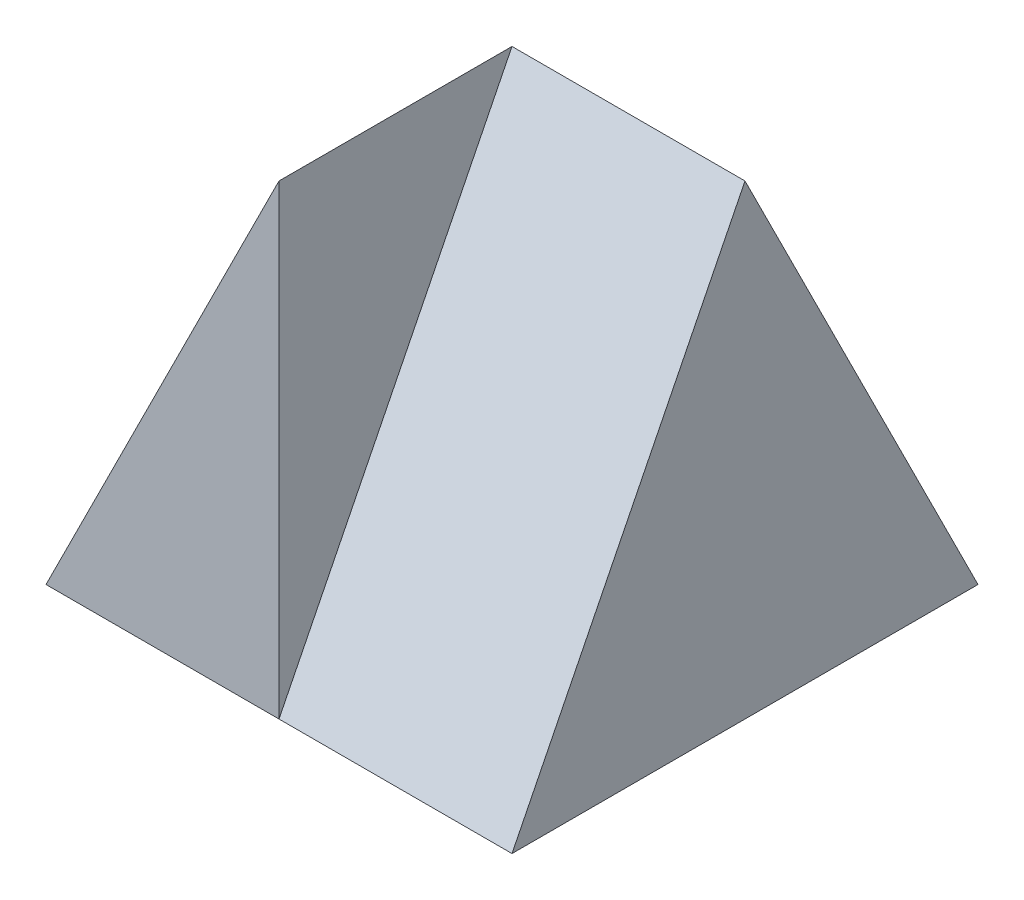
ISO-10303-21;
HEADER;
FILE_DESCRIPTION(('STEP AP214'),'2;1');
FILE_NAME('part.step','',(''),(''),'','','');
FILE_SCHEMA(('AUTOMOTIVE_DESIGN { 1 0 10303 214 1 1 1 1 }'));
ENDSEC;
DATA;
#1=APPLICATION_CONTEXT('core data for automotive mechanical design processes');
#2=APPLICATION_PROTOCOL_DEFINITION('international standard','automotive_design',2000,#1);
#3=PRODUCT_CONTEXT('',#1,'mechanical');
#4=PRODUCT('Part','Part','',(#3));
#5=PRODUCT_RELATED_PRODUCT_CATEGORY('part','',(#4));
#6=PRODUCT_DEFINITION_FORMATION('','',#4);
#7=PRODUCT_DEFINITION_CONTEXT('part definition',#1,'design');
#8=PRODUCT_DEFINITION('design','',#6,#7);
#9=PRODUCT_DEFINITION_SHAPE('','',#8);
#10=(LENGTH_UNIT() NAMED_UNIT(*) SI_UNIT(.MILLI.,.METRE.));
#11=(NAMED_UNIT(*) PLANE_ANGLE_UNIT() SI_UNIT($,.RADIAN.));
#12=(NAMED_UNIT(*) SI_UNIT($,.STERADIAN.) SOLID_ANGLE_UNIT());
#13=UNCERTAINTY_MEASURE_WITH_UNIT(LENGTH_MEASURE(1.E-05),#10,'distance_accuracy_value','');
#14=(GEOMETRIC_REPRESENTATION_CONTEXT(3) GLOBAL_UNCERTAINTY_ASSIGNED_CONTEXT((#13)) GLOBAL_UNIT_ASSIGNED_CONTEXT((#10,
#11,#12)) REPRESENTATION_CONTEXT('',''));
#15=CARTESIAN_POINT('',(0.,0.,0.));
#16=DIRECTION('',(0.,0.,1.));
#17=DIRECTION('',(1.,0.,0.));
#18=AXIS2_PLACEMENT_3D('',#15,#16,#17);
#19=CARTESIAN_POINT('',(20.,16.,32.));
#20=DIRECTION('',(0.,-0.447213595499958,-0.894427190999916));
#21=DIRECTION('',(0.,0.894427190999916,-0.447213595499958));
#22=AXIS2_PLACEMENT_3D('',#19,#20,#21);
#23=PLANE('',#22);
#24=DIRECTION('',(1.,0.,0.));
#25=VECTOR('',#24,1.);
#26=CARTESIAN_POINT('',(20.,40.,20.));
#27=LINE('',#26,#25);
#28=CARTESIAN_POINT('',(20.,40.,20.));
#29=VERTEX_POINT('',#28);
#30=CARTESIAN_POINT('',(40.,40.,20.));
#31=VERTEX_POINT('',#30);
#32=EDGE_CURVE('E109',#29,#31,#27,.T.);
#33=ORIENTED_EDGE('',*,*,#32,.F.);
#34=DIRECTION('',(0.,0.894427190999916,-0.447213595499958));
#35=VECTOR('',#34,1.);
#36=CARTESIAN_POINT('',(20.,16.,32.));
#37=LINE('',#36,#35);
#38=CARTESIAN_POINT('',(20.,0.,40.));
#39=VERTEX_POINT('',#38);
#40=EDGE_CURVE('E113',#39,#29,#37,.T.);
#41=ORIENTED_EDGE('',*,*,#40,.F.);
#42=DIRECTION('',(1.,0.,0.));
#43=VECTOR('',#42,1.);
#44=CARTESIAN_POINT('',(20.,0.,40.));
#45=LINE('',#44,#43);
#46=CARTESIAN_POINT('',(40.,0.,40.));
#47=VERTEX_POINT('',#46);
#48=EDGE_CURVE('E106',#39,#47,#45,.T.);
#49=ORIENTED_EDGE('',*,*,#48,.T.);
#50=DIRECTION('',(0.,0.894427190999916,-0.447213595499958));
#51=VECTOR('',#50,1.);
#52=CARTESIAN_POINT('',(40.,16.,32.));
#53=LINE('',#52,#51);
#54=EDGE_CURVE('E104',#47,#31,#53,.T.);
#55=ORIENTED_EDGE('',*,*,#54,.T.);
#56=EDGE_LOOP('',(#33,#41,#49,#55));
#57=FACE_BOUND('',#56,.T.);
#58=ADVANCED_FACE('F35',(#57),#23,.F.);
#59=CARTESIAN_POINT('',(0.,0.,40.));
#60=DIRECTION('',(0.,0.,-1.));
#61=DIRECTION('',(-1.,0.,0.));
#62=AXIS2_PLACEMENT_3D('',#59,#60,#61);
#63=PLANE('',#62);
#64=DIRECTION('',(0.,-1.,0.));
#65=VECTOR('',#64,1.);
#66=CARTESIAN_POINT('',(20.,0.,40.));
#67=LINE('',#66,#65);
#68=CARTESIAN_POINT('',(20.,40.,40.));
#69=VERTEX_POINT('',#68);
#70=EDGE_CURVE('E108',#69,#39,#67,.T.);
#71=ORIENTED_EDGE('',*,*,#70,.F.);
#72=DIRECTION('',(0.447213595499958,0.894427190999916,0.));
#73=VECTOR('',#72,1.);
#74=CARTESIAN_POINT('',(0.,0.,40.));
#75=LINE('',#74,#73);
#76=CARTESIAN_POINT('',(0.,0.,40.));
#77=VERTEX_POINT('',#76);
#78=EDGE_CURVE('E96',#77,#69,#75,.T.);
#79=ORIENTED_EDGE('',*,*,#78,.F.);
#80=DIRECTION('',(1.,0.,0.));
#81=VECTOR('',#80,1.);
#82=CARTESIAN_POINT('',(0.,0.,40.));
#83=LINE('',#82,#81);
#84=EDGE_CURVE('E98',#77,#39,#83,.T.);
#85=ORIENTED_EDGE('',*,*,#84,.T.);
#86=EDGE_LOOP('',(#71,#79,#85));
#87=FACE_BOUND('',#86,.T.);
#88=ADVANCED_FACE('F124',(#87),#63,.F.);
#89=CARTESIAN_POINT('',(0.,0.,40.));
#90=DIRECTION('',(0.,1.,0.));
#91=DIRECTION('',(0.,0.,1.));
#92=AXIS2_PLACEMENT_3D('',#89,#90,#91);
#93=PLANE('',#92);
#94=DIRECTION('',(-0.707106781186548,0.,0.707106781186548));
#95=VECTOR('',#94,1.);
#96=CARTESIAN_POINT('',(0.,0.,20.));
#97=LINE('',#96,#95);
#98=CARTESIAN_POINT('',(20.,0.,0.));
#99=VERTEX_POINT('',#98);
#100=CARTESIAN_POINT('',(0.,0.,20.));
#101=VERTEX_POINT('',#100);
#102=EDGE_CURVE('E11',#99,#101,#97,.T.);
#103=ORIENTED_EDGE('',*,*,#102,.F.);
#104=DIRECTION('',(1.,0.,0.));
#105=VECTOR('',#104,1.);
#106=CARTESIAN_POINT('',(0.,0.,0.));
#107=LINE('',#106,#105);
#108=CARTESIAN_POINT('',(40.,0.,0.));
#109=VERTEX_POINT('',#108);
#110=EDGE_CURVE('E79',#99,#109,#107,.T.);
#111=ORIENTED_EDGE('',*,*,#110,.T.);
#112=DIRECTION('',(0.,0.,-1.));
#113=VECTOR('',#112,1.);
#114=CARTESIAN_POINT('',(40.,0.,40.));
#115=LINE('',#114,#113);
#116=EDGE_CURVE('E94',#47,#109,#115,.T.);
#117=ORIENTED_EDGE('',*,*,#116,.F.);
#118=ORIENTED_EDGE('',*,*,#48,.F.);
#119=ORIENTED_EDGE('',*,*,#84,.F.);
#120=DIRECTION('',(0.,0.,-1.));
#121=VECTOR('',#120,1.);
#122=CARTESIAN_POINT('',(0.,0.,40.));
#123=LINE('',#122,#121);
#124=EDGE_CURVE('E82',#77,#101,#123,.T.);
#125=ORIENTED_EDGE('',*,*,#124,.T.);
#126=EDGE_LOOP('',(#103,#111,#117,#118,#119,#125));
#127=FACE_BOUND('',#126,.T.);
#128=ADVANCED_FACE('F76',(#127),#93,.F.);
#129=CARTESIAN_POINT('',(40.,0.,40.));
#130=DIRECTION('',(-1.,0.,0.));
#131=DIRECTION('',(0.,0.,1.));
#132=AXIS2_PLACEMENT_3D('',#129,#130,#131);
#133=PLANE('',#132);
#134=DIRECTION('',(0.,-0.894427190999916,-0.447213595499958));
#135=VECTOR('',#134,1.);
#136=CARTESIAN_POINT('',(40.,0.,0.));
#137=LINE('',#136,#135);
#138=EDGE_CURVE('E93',#31,#109,#137,.T.);
#139=ORIENTED_EDGE('',*,*,#138,.F.);
#140=ORIENTED_EDGE('',*,*,#54,.F.);
#141=ORIENTED_EDGE('',*,*,#116,.T.);
#142=EDGE_LOOP('',(#139,#140,#141));
#143=FACE_BOUND('',#142,.T.);
#144=ADVANCED_FACE('F127',(#143),#133,.F.);
#145=CARTESIAN_POINT('',(0.,0.,0.));
#146=DIRECTION('',(0.894427190999916,-0.447213595499958,0.));
#147=DIRECTION('',(0.447213595499958,0.894427190999916,0.));
#148=AXIS2_PLACEMENT_3D('',#145,#146,#147);
#149=PLANE('',#148);
#150=DIRECTION('',(0.,0.,1.));
#151=VECTOR('',#150,1.);
#152=CARTESIAN_POINT('',(20.,40.,0.));
#153=LINE('',#152,#151);
#154=EDGE_CURVE('E52',#29,#69,#153,.T.);
#155=ORIENTED_EDGE('',*,*,#154,.F.);
#156=DIRECTION('',(0.447213595499958,0.894427190999916,0.));
#157=VECTOR('',#156,1.);
#158=CARTESIAN_POINT('',(20.,40.,20.));
#159=LINE('',#158,#157);
#160=EDGE_CURVE('E88',#101,#29,#159,.T.);
#161=ORIENTED_EDGE('',*,*,#160,.F.);
#162=ORIENTED_EDGE('',*,*,#124,.F.);
#163=ORIENTED_EDGE('',*,*,#78,.T.);
#164=EDGE_LOOP('',(#155,#161,#162,#163));
#165=FACE_BOUND('',#164,.T.);
#166=ADVANCED_FACE('F37',(#165),#149,.F.);
#167=CARTESIAN_POINT('',(20.,0.,0.));
#168=DIRECTION('',(1.,0.,0.));
#169=DIRECTION('',(0.,0.,-1.));
#170=AXIS2_PLACEMENT_3D('',#167,#168,#169);
#171=PLANE('',#170);
#172=ORIENTED_EDGE('',*,*,#70,.T.);
#173=ORIENTED_EDGE('',*,*,#40,.T.);
#174=ORIENTED_EDGE('',*,*,#154,.T.);
#175=EDGE_LOOP('',(#172,#173,#174));
#176=FACE_BOUND('',#175,.T.);
#177=ADVANCED_FACE('F117',(#176),#171,.T.);
#178=CARTESIAN_POINT('',(20.,0.,0.));
#179=DIRECTION('',(0.,-0.447213595499958,0.894427190999916));
#180=DIRECTION('',(0.,-0.894427190999916,-0.447213595499958));
#181=AXIS2_PLACEMENT_3D('',#178,#179,#180);
#182=PLANE('',#181);
#183=ORIENTED_EDGE('',*,*,#138,.T.);
#184=ORIENTED_EDGE('',*,*,#110,.F.);
#185=DIRECTION('',(0.,-0.894427190999916,-0.447213595499958));
#186=VECTOR('',#185,1.);
#187=CARTESIAN_POINT('',(20.,0.,0.));
#188=LINE('',#187,#186);
#189=EDGE_CURVE('E39',#29,#99,#188,.T.);
#190=ORIENTED_EDGE('',*,*,#189,.F.);
#191=ORIENTED_EDGE('',*,*,#32,.T.);
#192=EDGE_LOOP('',(#183,#184,#190,#191));
#193=FACE_BOUND('',#192,.T.);
#194=ADVANCED_FACE('F91',(#193),#182,.F.);
#195=CARTESIAN_POINT('',(8.8888888888889,-4.44444444444445,8.88888888888889));
#196=DIRECTION('',(0.666666666666667,-0.333333333333333,0.666666666666667));
#197=DIRECTION('',(0.707106781186547,0.,-0.707106781186548));
#198=AXIS2_PLACEMENT_3D('',#195,#196,#197);
#199=PLANE('',#198);
#200=ORIENTED_EDGE('',*,*,#189,.T.);
#201=ORIENTED_EDGE('',*,*,#102,.T.);
#202=ORIENTED_EDGE('',*,*,#160,.T.);
#203=EDGE_LOOP('',(#200,#201,#202));
#204=FACE_BOUND('',#203,.T.);
#205=ADVANCED_FACE('F87',(#204),#199,.F.);
#206=CLOSED_SHELL('',(#58,#88,#128,#144,#166,#177,#194,#205));
#207=MANIFOLD_SOLID_BREP('B2',#206);
#208=ADVANCED_BREP_SHAPE_REPRESENTATION('',(#18,#207),#14);
#209=SHAPE_DEFINITION_REPRESENTATION(#9,#208);
ENDSEC;
END-ISO-10303-21;
